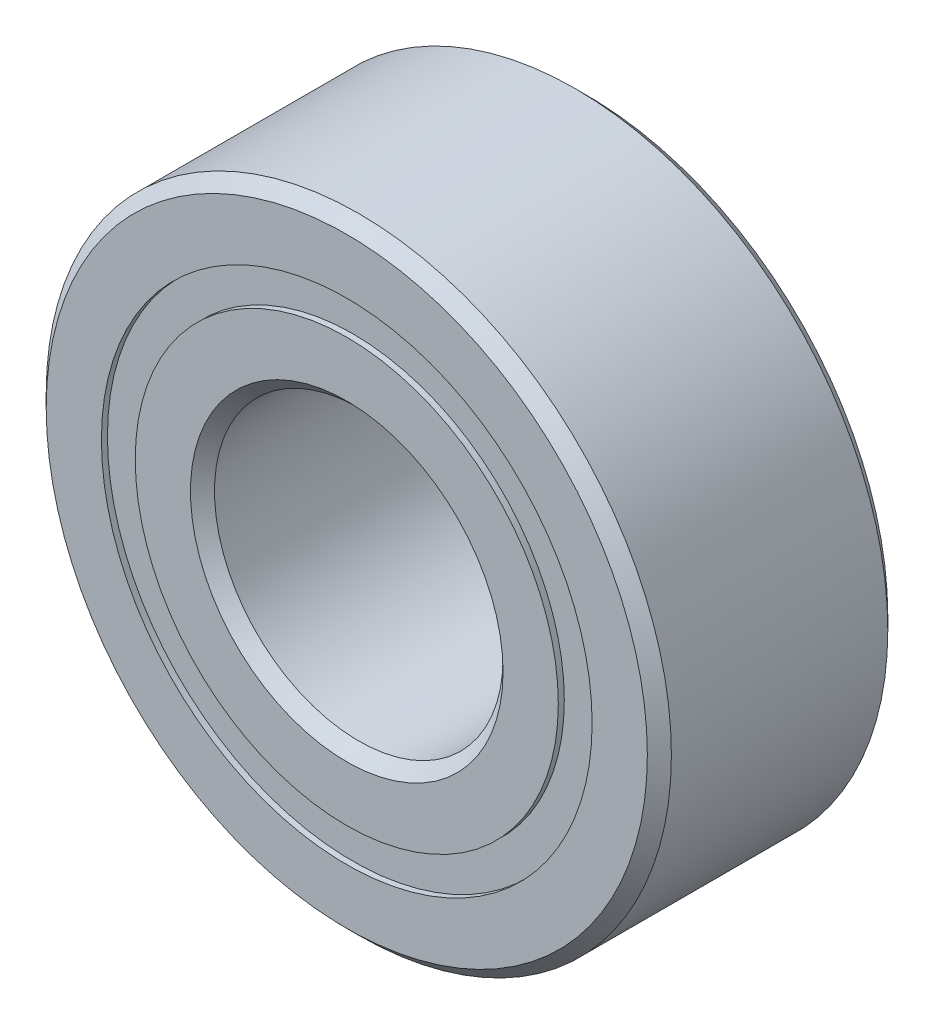
ISO-10303-21;
HEADER;
FILE_DESCRIPTION(('STEP AP214'),'2;1');
FILE_NAME('part.step','',(''),(''),'','','');
FILE_SCHEMA(('AUTOMOTIVE_DESIGN { 1 0 10303 214 1 1 1 1 }'));
ENDSEC;
DATA;
#1=APPLICATION_CONTEXT('core data for automotive mechanical design processes');
#2=APPLICATION_PROTOCOL_DEFINITION('international standard','automotive_design',2000,#1);
#3=PRODUCT_CONTEXT('',#1,'mechanical');
#4=PRODUCT('Part','Part','',(#3));
#5=PRODUCT_RELATED_PRODUCT_CATEGORY('part','',(#4));
#6=PRODUCT_DEFINITION_FORMATION('','',#4);
#7=PRODUCT_DEFINITION_CONTEXT('part definition',#1,'design');
#8=PRODUCT_DEFINITION('design','',#6,#7);
#9=PRODUCT_DEFINITION_SHAPE('','',#8);
#10=(LENGTH_UNIT() NAMED_UNIT(*) SI_UNIT(.MILLI.,.METRE.));
#11=(NAMED_UNIT(*) PLANE_ANGLE_UNIT() SI_UNIT($,.RADIAN.));
#12=(NAMED_UNIT(*) SI_UNIT($,.STERADIAN.) SOLID_ANGLE_UNIT());
#13=UNCERTAINTY_MEASURE_WITH_UNIT(LENGTH_MEASURE(1.E-05),#10,'distance_accuracy_value','');
#14=(GEOMETRIC_REPRESENTATION_CONTEXT(3) GLOBAL_UNCERTAINTY_ASSIGNED_CONTEXT((#13)) GLOBAL_UNIT_ASSIGNED_CONTEXT((#10,
#11,#12)) REPRESENTATION_CONTEXT('',''));
#15=CARTESIAN_POINT('',(0.,0.,0.));
#16=DIRECTION('',(0.,0.,1.));
#17=DIRECTION('',(1.,0.,0.));
#18=AXIS2_PLACEMENT_3D('',#15,#16,#17);
#19=CARTESIAN_POINT('',(0.,5.10164835164835,-2.375));
#20=DIRECTION('',(0.,0.,1.));
#21=DIRECTION('',(1.,0.,0.));
#22=AXIS2_PLACEMENT_3D('',#19,#20,#21);
#23=PLANE('',#22);
#24=CARTESIAN_POINT('',(0.,0.,-2.375));
#25=DIRECTION('',(0.,0.,1.));
#26=DIRECTION('',(1.,0.,0.));
#27=AXIS2_PLACEMENT_3D('',#24,#25,#26);
#28=CIRCLE('',#27,5.10164835164835);
#29=CARTESIAN_POINT('',(5.10164835164835,0.,-2.375));
#30=VERTEX_POINT('',#29);
#31=EDGE_CURVE('E70',#30,#30,#28,.T.);
#32=ORIENTED_EDGE('',*,*,#31,.F.);
#33=EDGE_LOOP('',(#32));
#34=FACE_BOUND('',#33,.T.);
#35=CARTESIAN_POINT('',(0.,0.,-2.375));
#36=DIRECTION('',(0.,0.,1.));
#37=DIRECTION('',(1.,0.,0.));
#38=AXIS2_PLACEMENT_3D('',#35,#36,#37);
#39=CIRCLE('',#38,4.39835164835165);
#40=CARTESIAN_POINT('',(4.39835164835165,0.,-2.375));
#41=VERTEX_POINT('',#40);
#42=EDGE_CURVE('E11',#41,#41,#39,.T.);
#43=ORIENTED_EDGE('',*,*,#42,.T.);
#44=EDGE_LOOP('',(#43));
#45=FACE_BOUND('',#44,.T.);
#46=ADVANCED_FACE('F56',(#34,#45),#23,.F.);
#47=CARTESIAN_POINT('',(0.,0.,2.5));
#48=DIRECTION('',(0.,0.,1.));
#49=DIRECTION('',(1.,0.,0.));
#50=AXIS2_PLACEMENT_3D('',#47,#48,#49);
#51=CYLINDRICAL_SURFACE('',#50,4.39835164835165);
#52=ORIENTED_EDGE('',*,*,#42,.F.);
#53=EDGE_LOOP('',(#52));
#54=FACE_BOUND('',#53,.T.);
#55=CARTESIAN_POINT('',(0.,0.,-1.16542887575844));
#56=DIRECTION('',(0.,0.,1.));
#57=DIRECTION('',(1.,0.,0.));
#58=AXIS2_PLACEMENT_3D('',#55,#56,#57);
#59=CIRCLE('',#58,4.39835164835165);
#60=CARTESIAN_POINT('',(4.39835164835165,0.,-1.16542887575844));
#61=VERTEX_POINT('',#60);
#62=EDGE_CURVE('E62',#61,#61,#59,.T.);
#63=ORIENTED_EDGE('',*,*,#62,.T.);
#64=EDGE_LOOP('',(#63));
#65=FACE_BOUND('',#64,.T.);
#66=ADVANCED_FACE('F79',(#54,#65),#51,.F.);
#67=CARTESIAN_POINT('',(0.,5.10164835164835,-1.16542887575844));
#68=DIRECTION('',(0.,0.,-1.));
#69=DIRECTION('',(-1.,0.,0.));
#70=AXIS2_PLACEMENT_3D('',#67,#68,#69);
#71=PLANE('',#70);
#72=ORIENTED_EDGE('',*,*,#62,.F.);
#73=EDGE_LOOP('',(#72));
#74=FACE_BOUND('',#73,.T.);
#75=CARTESIAN_POINT('',(0.,0.,-1.16542887575844));
#76=DIRECTION('',(0.,0.,1.));
#77=DIRECTION('',(1.,0.,0.));
#78=AXIS2_PLACEMENT_3D('',#75,#76,#77);
#79=CIRCLE('',#78,5.10164835164835);
#80=CARTESIAN_POINT('',(5.10164835164835,0.,-1.16542887575844));
#81=VERTEX_POINT('',#80);
#82=EDGE_CURVE('E66',#81,#81,#79,.T.);
#83=ORIENTED_EDGE('',*,*,#82,.T.);
#84=EDGE_LOOP('',(#83));
#85=FACE_BOUND('',#84,.T.);
#86=ADVANCED_FACE('F83',(#74,#85),#71,.F.);
#87=CARTESIAN_POINT('',(0.,0.,2.5));
#88=DIRECTION('',(0.,0.,1.));
#89=DIRECTION('',(1.,0.,0.));
#90=AXIS2_PLACEMENT_3D('',#87,#88,#89);
#91=CYLINDRICAL_SURFACE('',#90,5.10164835164835);
#92=ORIENTED_EDGE('',*,*,#82,.F.);
#93=EDGE_LOOP('',(#92));
#94=FACE_BOUND('',#93,.T.);
#95=ORIENTED_EDGE('',*,*,#31,.T.);
#96=EDGE_LOOP('',(#95));
#97=FACE_BOUND('',#96,.T.);
#98=ADVANCED_FACE('F76',(#94,#97),#91,.T.);
#99=CLOSED_SHELL('',(#46,#66,#86,#98));
#100=MANIFOLD_SOLID_BREP('B2',#99);
#101=CARTESIAN_POINT('',(0.,5.10164835164835,2.375));
#102=DIRECTION('',(0.,0.,-1.));
#103=DIRECTION('',(-1.,0.,0.));
#104=AXIS2_PLACEMENT_3D('',#101,#102,#103);
#105=PLANE('',#104);
#106=CARTESIAN_POINT('',(0.,0.,2.375));
#107=DIRECTION('',(0.,0.,1.));
#108=DIRECTION('',(1.,0.,0.));
#109=AXIS2_PLACEMENT_3D('',#106,#107,#108);
#110=CIRCLE('',#109,4.39835164835165);
#111=CARTESIAN_POINT('',(4.39835164835165,0.,2.375));
#112=VERTEX_POINT('',#111);
#113=EDGE_CURVE('E55',#112,#112,#110,.T.);
#114=ORIENTED_EDGE('',*,*,#113,.F.);
#115=EDGE_LOOP('',(#114));
#116=FACE_BOUND('',#115,.T.);
#117=CARTESIAN_POINT('',(0.,0.,2.375));
#118=DIRECTION('',(0.,0.,1.));
#119=DIRECTION('',(1.,0.,0.));
#120=AXIS2_PLACEMENT_3D('',#117,#118,#119);
#121=CIRCLE('',#120,5.10164835164835);
#122=CARTESIAN_POINT('',(5.10164835164835,0.,2.375));
#123=VERTEX_POINT('',#122);
#124=EDGE_CURVE('E133',#123,#123,#121,.T.);
#125=ORIENTED_EDGE('',*,*,#124,.T.);
#126=EDGE_LOOP('',(#125));
#127=FACE_BOUND('',#126,.T.);
#128=ADVANCED_FACE('F119',(#116,#127),#105,.F.);
#129=CARTESIAN_POINT('',(0.,0.,2.5));
#130=DIRECTION('',(0.,0.,1.));
#131=DIRECTION('',(1.,0.,0.));
#132=AXIS2_PLACEMENT_3D('',#129,#130,#131);
#133=CYLINDRICAL_SURFACE('',#132,4.39835164835165);
#134=CARTESIAN_POINT('',(0.,0.,1.16542887575844));
#135=DIRECTION('',(0.,0.,1.));
#136=DIRECTION('',(1.,0.,0.));
#137=AXIS2_PLACEMENT_3D('',#134,#135,#136);
#138=CIRCLE('',#137,4.39835164835165);
#139=CARTESIAN_POINT('',(4.39835164835165,0.,1.16542887575844));
#140=VERTEX_POINT('',#139);
#141=EDGE_CURVE('E125',#140,#140,#138,.T.);
#142=ORIENTED_EDGE('',*,*,#141,.F.);
#143=EDGE_LOOP('',(#142));
#144=FACE_BOUND('',#143,.T.);
#145=ORIENTED_EDGE('',*,*,#113,.T.);
#146=EDGE_LOOP('',(#145));
#147=FACE_BOUND('',#146,.T.);
#148=ADVANCED_FACE('F148',(#144,#147),#133,.F.);
#149=CARTESIAN_POINT('',(0.,5.10164835164835,1.16542887575844));
#150=DIRECTION('',(0.,0.,1.));
#151=DIRECTION('',(1.,0.,0.));
#152=AXIS2_PLACEMENT_3D('',#149,#150,#151);
#153=PLANE('',#152);
#154=CARTESIAN_POINT('',(0.,0.,1.16542887575844));
#155=DIRECTION('',(0.,0.,1.));
#156=DIRECTION('',(1.,0.,0.));
#157=AXIS2_PLACEMENT_3D('',#154,#155,#156);
#158=CIRCLE('',#157,5.10164835164835);
#159=CARTESIAN_POINT('',(5.10164835164835,0.,1.16542887575844));
#160=VERTEX_POINT('',#159);
#161=EDGE_CURVE('E129',#160,#160,#158,.T.);
#162=ORIENTED_EDGE('',*,*,#161,.F.);
#163=EDGE_LOOP('',(#162));
#164=FACE_BOUND('',#163,.T.);
#165=ORIENTED_EDGE('',*,*,#141,.T.);
#166=EDGE_LOOP('',(#165));
#167=FACE_BOUND('',#166,.T.);
#168=ADVANCED_FACE('F143',(#164,#167),#153,.F.);
#169=CARTESIAN_POINT('',(0.,0.,2.5));
#170=DIRECTION('',(0.,0.,1.));
#171=DIRECTION('',(1.,0.,0.));
#172=AXIS2_PLACEMENT_3D('',#169,#170,#171);
#173=CYLINDRICAL_SURFACE('',#172,5.10164835164835);
#174=ORIENTED_EDGE('',*,*,#124,.F.);
#175=EDGE_LOOP('',(#174));
#176=FACE_BOUND('',#175,.T.);
#177=ORIENTED_EDGE('',*,*,#161,.T.);
#178=EDGE_LOOP('',(#177));
#179=FACE_BOUND('',#178,.T.);
#180=ADVANCED_FACE('F140',(#176,#179),#173,.T.);
#181=CLOSED_SHELL('',(#128,#148,#168,#180));
#182=MANIFOLD_SOLID_BREP('B6',#181);
#183=CARTESIAN_POINT('',(-2.37499999999995,4.11362066797611,0.));
#184=DIRECTION('',(0.,0.,1.));
#185=DIRECTION('',(-0.499999999999989,0.866025403784445,0.));
#186=AXIS2_PLACEMENT_3D('',#183,#184,#185);
#187=SPHERICAL_SURFACE('',#186,1.16542887575844);
#188=CARTESIAN_POINT('',(-2.37499999999995,4.11362066797611,1.16542887575844));
#189=VERTEX_POINT('',#188);
#190=VERTEX_LOOP('',#189);
#191=FACE_BOUND('',#190,.T.);
#192=ADVANCED_FACE('F182',(#191),#187,.T.);
#193=CLOSED_SHELL('',(#192));
#194=MANIFOLD_SOLID_BREP('B50',#193);
#195=CARTESIAN_POINT('',(-4.11362066797606,2.37500000000005,0.));
#196=DIRECTION('',(0.,0.,1.));
#197=DIRECTION('',(-0.866025403784433,0.50000000000001,0.));
#198=AXIS2_PLACEMENT_3D('',#195,#196,#197);
#199=SPHERICAL_SURFACE('',#198,1.16542887575844);
#200=CARTESIAN_POINT('',(-4.11362066797606,2.37500000000005,1.16542887575844));
#201=VERTEX_POINT('',#200);
#202=VERTEX_LOOP('',#201);
#203=FACE_BOUND('',#202,.T.);
#204=ADVANCED_FACE('F205',(#203),#199,.T.);
#205=CLOSED_SHELL('',(#204));
#206=MANIFOLD_SOLID_BREP('B115',#205);
#207=CARTESIAN_POINT('',(-4.75,0.,0.));
#208=DIRECTION('',(0.,0.,1.));
#209=DIRECTION('',(-1.,0.,0.));
#210=AXIS2_PLACEMENT_3D('',#207,#208,#209);
#211=SPHERICAL_SURFACE('',#210,1.16542887575844);
#212=CARTESIAN_POINT('',(-4.75,0.,1.16542887575844));
#213=VERTEX_POINT('',#212);
#214=VERTEX_LOOP('',#213);
#215=FACE_BOUND('',#214,.T.);
#216=ADVANCED_FACE('F228',(#215),#211,.T.);
#217=CLOSED_SHELL('',(#216));
#218=MANIFOLD_SOLID_BREP('B178',#217);
#219=CARTESIAN_POINT('',(-4.1136206679761,-2.37499999999996,0.));
#220=DIRECTION('',(0.,0.,1.));
#221=DIRECTION('',(-0.866025403784443,-0.499999999999992,0.));
#222=AXIS2_PLACEMENT_3D('',#219,#220,#221);
#223=SPHERICAL_SURFACE('',#222,1.16542887575844);
#224=CARTESIAN_POINT('',(-4.1136206679761,-2.37499999999996,1.16542887575844));
#225=VERTEX_POINT('',#224);
#226=VERTEX_LOOP('',#225);
#227=FACE_BOUND('',#226,.T.);
#228=ADVANCED_FACE('F251',(#227),#223,.T.);
#229=CLOSED_SHELL('',(#228));
#230=MANIFOLD_SOLID_BREP('B201',#229);
#231=CARTESIAN_POINT('',(-2.37500000000003,-4.11362066797606,0.));
#232=DIRECTION('',(0.,0.,1.));
#233=DIRECTION('',(-0.500000000000007,-0.866025403784435,0.));
#234=AXIS2_PLACEMENT_3D('',#231,#232,#233);
#235=SPHERICAL_SURFACE('',#234,1.16542887575844);
#236=CARTESIAN_POINT('',(-2.37500000000003,-4.11362066797606,1.16542887575844));
#237=VERTEX_POINT('',#236);
#238=VERTEX_LOOP('',#237);
#239=FACE_BOUND('',#238,.T.);
#240=ADVANCED_FACE('F274',(#239),#235,.T.);
#241=CLOSED_SHELL('',(#240));
#242=MANIFOLD_SOLID_BREP('B224',#241);
#243=CARTESIAN_POINT('',(0.,-4.75,0.));
#244=DIRECTION('',(0.,0.,1.));
#245=DIRECTION('',(0.,-1.,0.));
#246=AXIS2_PLACEMENT_3D('',#243,#244,#245);
#247=SPHERICAL_SURFACE('',#246,1.16542887575844);
#248=CARTESIAN_POINT('',(0.,-4.75,1.16542887575844));
#249=VERTEX_POINT('',#248);
#250=VERTEX_LOOP('',#249);
#251=FACE_BOUND('',#250,.T.);
#252=ADVANCED_FACE('F297',(#251),#247,.T.);
#253=CLOSED_SHELL('',(#252));
#254=MANIFOLD_SOLID_BREP('B247',#253);
#255=CARTESIAN_POINT('',(2.37499999999998,-4.1136206679761,0.));
#256=DIRECTION('',(0.,0.,1.));
#257=DIRECTION('',(0.499999999999995,-0.866025403784442,0.));
#258=AXIS2_PLACEMENT_3D('',#255,#256,#257);
#259=SPHERICAL_SURFACE('',#258,1.16542887575844);
#260=CARTESIAN_POINT('',(2.37499999999998,-4.1136206679761,1.16542887575844));
#261=VERTEX_POINT('',#260);
#262=VERTEX_LOOP('',#261);
#263=FACE_BOUND('',#262,.T.);
#264=ADVANCED_FACE('F320',(#263),#259,.T.);
#265=CLOSED_SHELL('',(#264));
#266=MANIFOLD_SOLID_BREP('B270',#265);
#267=CARTESIAN_POINT('',(4.11362066797607,-2.37500000000002,0.));
#268=DIRECTION('',(0.,0.,1.));
#269=DIRECTION('',(0.866025403784436,-0.500000000000004,0.));
#270=AXIS2_PLACEMENT_3D('',#267,#268,#269);
#271=SPHERICAL_SURFACE('',#270,1.16542887575844);
#272=CARTESIAN_POINT('',(4.11362066797607,-2.37500000000002,1.16542887575844));
#273=VERTEX_POINT('',#272);
#274=VERTEX_LOOP('',#273);
#275=FACE_BOUND('',#274,.T.);
#276=ADVANCED_FACE('F343',(#275),#271,.T.);
#277=CLOSED_SHELL('',(#276));
#278=MANIFOLD_SOLID_BREP('B293',#277);
#279=CARTESIAN_POINT('',(4.75,0.,0.));
#280=DIRECTION('',(0.,0.,1.));
#281=DIRECTION('',(1.,0.,0.));
#282=AXIS2_PLACEMENT_3D('',#279,#280,#281);
#283=SPHERICAL_SURFACE('',#282,1.16542887575844);
#284=CARTESIAN_POINT('',(4.75,0.,1.16542887575844));
#285=VERTEX_POINT('',#284);
#286=VERTEX_LOOP('',#285);
#287=FACE_BOUND('',#286,.T.);
#288=ADVANCED_FACE('F366',(#287),#283,.T.);
#289=CLOSED_SHELL('',(#288));
#290=MANIFOLD_SOLID_BREP('B316',#289);
#291=CARTESIAN_POINT('',(4.11362066797609,2.37499999999999,0.));
#292=DIRECTION('',(0.,0.,1.));
#293=DIRECTION('',(0.86602540378444,0.499999999999998,0.));
#294=AXIS2_PLACEMENT_3D('',#291,#292,#293);
#295=SPHERICAL_SURFACE('',#294,1.16542887575844);
#296=CARTESIAN_POINT('',(4.11362066797609,2.37499999999999,1.16542887575844));
#297=VERTEX_POINT('',#296);
#298=VERTEX_LOOP('',#297);
#299=FACE_BOUND('',#298,.T.);
#300=ADVANCED_FACE('F389',(#299),#295,.T.);
#301=CLOSED_SHELL('',(#300));
#302=MANIFOLD_SOLID_BREP('B339',#301);
#303=CARTESIAN_POINT('',(2.375,4.11362066797608,0.));
#304=DIRECTION('',(0.,0.,1.));
#305=DIRECTION('',(0.500000000000001,0.866025403784438,0.));
#306=AXIS2_PLACEMENT_3D('',#303,#304,#305);
#307=SPHERICAL_SURFACE('',#306,1.16542887575844);
#308=CARTESIAN_POINT('',(2.375,4.11362066797608,1.16542887575844));
#309=VERTEX_POINT('',#308);
#310=VERTEX_LOOP('',#309);
#311=FACE_BOUND('',#310,.T.);
#312=ADVANCED_FACE('F412',(#311),#307,.T.);
#313=CLOSED_SHELL('',(#312));
#314=MANIFOLD_SOLID_BREP('B362',#313);
#315=CARTESIAN_POINT('',(0.,4.75,0.));
#316=DIRECTION('',(0.,0.,1.));
#317=DIRECTION('',(0.,1.,0.));
#318=AXIS2_PLACEMENT_3D('',#315,#316,#317);
#319=SPHERICAL_SURFACE('',#318,1.16542887575844);
#320=CARTESIAN_POINT('',(0.,4.75,1.16542887575844));
#321=VERTEX_POINT('',#320);
#322=VERTEX_LOOP('',#321);
#323=FACE_BOUND('',#322,.T.);
#324=ADVANCED_FACE('F437',(#323),#319,.T.);
#325=CLOSED_SHELL('',(#324));
#326=MANIFOLD_SOLID_BREP('B385',#325);
#327=CARTESIAN_POINT('',(0.,4.39835164835165,2.5));
#328=DIRECTION('',(0.,0.,-1.));
#329=DIRECTION('',(-1.,0.,0.));
#330=AXIS2_PLACEMENT_3D('',#327,#328,#329);
#331=PLANE('',#330);
#332=CARTESIAN_POINT('',(0.,0.,2.5));
#333=DIRECTION('',(0.,0.,1.));
#334=DIRECTION('',(1.,0.,0.));
#335=AXIS2_PLACEMENT_3D('',#332,#333,#334);
#336=CIRCLE('',#335,3.25);
#337=CARTESIAN_POINT('',(3.25,0.,2.5));
#338=VERTEX_POINT('',#337);
#339=EDGE_CURVE('E483',#338,#338,#336,.T.);
#340=ORIENTED_EDGE('',*,*,#339,.F.);
#341=EDGE_LOOP('',(#340));
#342=FACE_BOUND('',#341,.T.);
#343=CARTESIAN_POINT('',(0.,0.,2.5));
#344=DIRECTION('',(0.,0.,1.));
#345=DIRECTION('',(1.,0.,0.));
#346=AXIS2_PLACEMENT_3D('',#343,#344,#345);
#347=CIRCLE('',#346,4.39835164835165);
#348=CARTESIAN_POINT('',(4.39835164835165,0.,2.5));
#349=VERTEX_POINT('',#348);
#350=EDGE_CURVE('E436',#349,#349,#347,.T.);
#351=ORIENTED_EDGE('',*,*,#350,.T.);
#352=EDGE_LOOP('',(#351));
#353=FACE_BOUND('',#352,.T.);
#354=ADVANCED_FACE('F455',(#342,#353),#331,.F.);
#355=CARTESIAN_POINT('',(0.,0.,2.5));
#356=DIRECTION('',(0.,0.,1.));
#357=DIRECTION('',(1.,0.,0.));
#358=AXIS2_PLACEMENT_3D('',#355,#356,#357);
#359=CYLINDRICAL_SURFACE('',#358,4.39835164835165);
#360=ORIENTED_EDGE('',*,*,#350,.F.);
#361=EDGE_LOOP('',(#360));
#362=FACE_BOUND('',#361,.T.);
#363=CARTESIAN_POINT('',(0.,0.,1.11111111111111));
#364=DIRECTION('',(0.,0.,1.));
#365=DIRECTION('',(1.,0.,0.));
#366=AXIS2_PLACEMENT_3D('',#363,#364,#365);
#367=CIRCLE('',#366,4.39835164835165);
#368=CARTESIAN_POINT('',(4.39835164835165,0.,1.11111111111111));
#369=VERTEX_POINT('',#368);
#370=EDGE_CURVE('E461',#369,#369,#367,.T.);
#371=ORIENTED_EDGE('',*,*,#370,.T.);
#372=EDGE_LOOP('',(#371));
#373=FACE_BOUND('',#372,.T.);
#374=ADVANCED_FACE('F490',(#362,#373),#359,.T.);
#375=CARTESIAN_POINT('',(0.,0.,0.));
#376=DIRECTION('',(0.,0.,1.));
#377=DIRECTION('',(1.,0.,0.));
#378=AXIS2_PLACEMENT_3D('',#375,#376,#377);
#379=TOROIDAL_SURFACE('',#378,4.75,1.16542887575843);
#380=ORIENTED_EDGE('',*,*,#370,.F.);
#381=EDGE_LOOP('',(#380));
#382=FACE_BOUND('',#381,.T.);
#383=CARTESIAN_POINT('',(0.,0.,-1.11111111111111));
#384=DIRECTION('',(0.,0.,1.));
#385=DIRECTION('',(1.,0.,0.));
#386=AXIS2_PLACEMENT_3D('',#383,#384,#385);
#387=CIRCLE('',#386,4.39835164835165);
#388=CARTESIAN_POINT('',(4.39835164835165,0.,-1.11111111111111));
#389=VERTEX_POINT('',#388);
#390=EDGE_CURVE('E465',#389,#389,#387,.T.);
#391=ORIENTED_EDGE('',*,*,#390,.T.);
#392=EDGE_LOOP('',(#391));
#393=FACE_BOUND('',#392,.T.);
#394=ADVANCED_FACE('F494',(#382,#393),#379,.F.);
#395=CARTESIAN_POINT('',(0.,0.,2.5));
#396=DIRECTION('',(0.,0.,1.));
#397=DIRECTION('',(1.,0.,0.));
#398=AXIS2_PLACEMENT_3D('',#395,#396,#397);
#399=CYLINDRICAL_SURFACE('',#398,4.39835164835165);
#400=ORIENTED_EDGE('',*,*,#390,.F.);
#401=EDGE_LOOP('',(#400));
#402=FACE_BOUND('',#401,.T.);
#403=CARTESIAN_POINT('',(0.,0.,-2.5));
#404=DIRECTION('',(0.,0.,1.));
#405=DIRECTION('',(1.,0.,0.));
#406=AXIS2_PLACEMENT_3D('',#403,#404,#405);
#407=CIRCLE('',#406,4.39835164835165);
#408=CARTESIAN_POINT('',(4.39835164835165,0.,-2.5));
#409=VERTEX_POINT('',#408);
#410=EDGE_CURVE('E469',#409,#409,#407,.T.);
#411=ORIENTED_EDGE('',*,*,#410,.T.);
#412=EDGE_LOOP('',(#411));
#413=FACE_BOUND('',#412,.T.);
#414=ADVANCED_FACE('F499',(#402,#413),#399,.T.);
#415=CARTESIAN_POINT('',(0.,3.25,-2.5));
#416=DIRECTION('',(0.,0.,1.));
#417=DIRECTION('',(1.,0.,0.));
#418=AXIS2_PLACEMENT_3D('',#415,#416,#417);
#419=PLANE('',#418);
#420=ORIENTED_EDGE('',*,*,#410,.F.);
#421=EDGE_LOOP('',(#420));
#422=FACE_BOUND('',#421,.T.);
#423=CARTESIAN_POINT('',(0.,0.,-2.5));
#424=DIRECTION('',(0.,0.,1.));
#425=DIRECTION('',(1.,0.,0.));
#426=AXIS2_PLACEMENT_3D('',#423,#424,#425);
#427=CIRCLE('',#426,3.25);
#428=CARTESIAN_POINT('',(3.25,0.,-2.5));
#429=VERTEX_POINT('',#428);
#430=EDGE_CURVE('E474',#429,#429,#427,.T.);
#431=ORIENTED_EDGE('',*,*,#430,.T.);
#432=EDGE_LOOP('',(#431));
#433=FACE_BOUND('',#432,.T.);
#434=ADVANCED_FACE('F505',(#422,#433),#419,.F.);
#435=CARTESIAN_POINT('',(0.,0.,-2.25));
#436=DIRECTION('',(0.,0.,-1.));
#437=DIRECTION('',(-1.,0.,0.));
#438=AXIS2_PLACEMENT_3D('',#435,#436,#437);
#439=CONICAL_SURFACE('',#438,3.,0.785398163397447);
#440=ORIENTED_EDGE('',*,*,#430,.F.);
#441=EDGE_LOOP('',(#440));
#442=FACE_BOUND('',#441,.T.);
#443=CARTESIAN_POINT('',(0.,0.,-2.25));
#444=DIRECTION('',(0.,0.,1.));
#445=DIRECTION('',(1.,0.,0.));
#446=AXIS2_PLACEMENT_3D('',#443,#444,#445);
#447=CIRCLE('',#446,3.);
#448=CARTESIAN_POINT('',(3.,0.,-2.25));
#449=VERTEX_POINT('',#448);
#450=EDGE_CURVE('E477',#449,#449,#447,.T.);
#451=ORIENTED_EDGE('',*,*,#450,.T.);
#452=EDGE_LOOP('',(#451));
#453=FACE_BOUND('',#452,.T.);
#454=ADVANCED_FACE('F508',(#442,#453),#439,.F.);
#455=CARTESIAN_POINT('',(0.,0.,2.5));
#456=DIRECTION('',(0.,0.,1.));
#457=DIRECTION('',(1.,0.,0.));
#458=AXIS2_PLACEMENT_3D('',#455,#456,#457);
#459=CYLINDRICAL_SURFACE('',#458,3.);
#460=ORIENTED_EDGE('',*,*,#450,.F.);
#461=EDGE_LOOP('',(#460));
#462=FACE_BOUND('',#461,.T.);
#463=CARTESIAN_POINT('',(0.,0.,2.25));
#464=DIRECTION('',(0.,0.,1.));
#465=DIRECTION('',(1.,0.,0.));
#466=AXIS2_PLACEMENT_3D('',#463,#464,#465);
#467=CIRCLE('',#466,3.);
#468=CARTESIAN_POINT('',(3.,0.,2.25));
#469=VERTEX_POINT('',#468);
#470=EDGE_CURVE('E480',#469,#469,#467,.T.);
#471=ORIENTED_EDGE('',*,*,#470,.T.);
#472=EDGE_LOOP('',(#471));
#473=FACE_BOUND('',#472,.T.);
#474=ADVANCED_FACE('F512',(#462,#473),#459,.F.);
#475=CARTESIAN_POINT('',(0.,0.,2.5));
#476=DIRECTION('',(0.,0.,1.));
#477=DIRECTION('',(1.,0.,0.));
#478=AXIS2_PLACEMENT_3D('',#475,#476,#477);
#479=CONICAL_SURFACE('',#478,3.25,0.785398163397452);
#480=ORIENTED_EDGE('',*,*,#470,.F.);
#481=EDGE_LOOP('',(#480));
#482=FACE_BOUND('',#481,.T.);
#483=ORIENTED_EDGE('',*,*,#339,.T.);
#484=EDGE_LOOP('',(#483));
#485=FACE_BOUND('',#484,.T.);
#486=ADVANCED_FACE('F487',(#482,#485),#479,.F.);
#487=CLOSED_SHELL('',(#354,#374,#394,#414,#434,#454,#474,#486));
#488=MANIFOLD_SOLID_BREP('B408',#487);
#489=CARTESIAN_POINT('',(0.,0.,2.25));
#490=DIRECTION('',(0.,0.,-1.));
#491=DIRECTION('',(-1.,0.,0.));
#492=AXIS2_PLACEMENT_3D('',#489,#490,#491);
#493=CONICAL_SURFACE('',#492,6.5,0.785398163397445);
#494=CARTESIAN_POINT('',(0.,0.,2.5));
#495=DIRECTION('',(0.,0.,1.));
#496=DIRECTION('',(1.,0.,0.));
#497=AXIS2_PLACEMENT_3D('',#494,#495,#496);
#498=CIRCLE('',#497,6.25);
#499=CARTESIAN_POINT('',(6.25,0.,2.5));
#500=VERTEX_POINT('',#499);
#501=EDGE_CURVE('E594',#500,#500,#498,.T.);
#502=ORIENTED_EDGE('',*,*,#501,.F.);
#503=EDGE_LOOP('',(#502));
#504=FACE_BOUND('',#503,.T.);
#505=CARTESIAN_POINT('',(0.,0.,2.25));
#506=DIRECTION('',(0.,0.,1.));
#507=DIRECTION('',(1.,0.,0.));
#508=AXIS2_PLACEMENT_3D('',#505,#506,#507);
#509=CIRCLE('',#508,6.5);
#510=CARTESIAN_POINT('',(6.5,0.,2.25));
#511=VERTEX_POINT('',#510);
#512=EDGE_CURVE('E454',#511,#511,#509,.T.);
#513=ORIENTED_EDGE('',*,*,#512,.T.);
#514=EDGE_LOOP('',(#513));
#515=FACE_BOUND('',#514,.T.);
#516=ADVANCED_FACE('F566',(#504,#515),#493,.T.);
#517=CARTESIAN_POINT('',(0.,0.,2.5));
#518=DIRECTION('',(0.,0.,1.));
#519=DIRECTION('',(1.,0.,0.));
#520=AXIS2_PLACEMENT_3D('',#517,#518,#519);
#521=CYLINDRICAL_SURFACE('',#520,6.5);
#522=ORIENTED_EDGE('',*,*,#512,.F.);
#523=EDGE_LOOP('',(#522));
#524=FACE_BOUND('',#523,.T.);
#525=CARTESIAN_POINT('',(0.,0.,-2.25));
#526=DIRECTION('',(0.,0.,1.));
#527=DIRECTION('',(1.,0.,0.));
#528=AXIS2_PLACEMENT_3D('',#525,#526,#527);
#529=CIRCLE('',#528,6.5);
#530=CARTESIAN_POINT('',(6.5,0.,-2.25));
#531=VERTEX_POINT('',#530);
#532=EDGE_CURVE('E572',#531,#531,#529,.T.);
#533=ORIENTED_EDGE('',*,*,#532,.T.);
#534=EDGE_LOOP('',(#533));
#535=FACE_BOUND('',#534,.T.);
#536=ADVANCED_FACE('F601',(#524,#535),#521,.T.);
#537=CARTESIAN_POINT('',(0.,0.,-2.5));
#538=DIRECTION('',(0.,0.,1.));
#539=DIRECTION('',(1.,0.,0.));
#540=AXIS2_PLACEMENT_3D('',#537,#538,#539);
#541=CONICAL_SURFACE('',#540,6.25,0.785398163397445);
#542=ORIENTED_EDGE('',*,*,#532,.F.);
#543=EDGE_LOOP('',(#542));
#544=FACE_BOUND('',#543,.T.);
#545=CARTESIAN_POINT('',(0.,0.,-2.5));
#546=DIRECTION('',(0.,0.,1.));
#547=DIRECTION('',(1.,0.,0.));
#548=AXIS2_PLACEMENT_3D('',#545,#546,#547);
#549=CIRCLE('',#548,6.25);
#550=CARTESIAN_POINT('',(6.25,0.,-2.5));
#551=VERTEX_POINT('',#550);
#552=EDGE_CURVE('E576',#551,#551,#549,.T.);
#553=ORIENTED_EDGE('',*,*,#552,.T.);
#554=EDGE_LOOP('',(#553));
#555=FACE_BOUND('',#554,.T.);
#556=ADVANCED_FACE('F605',(#544,#555),#541,.T.);
#557=CARTESIAN_POINT('',(0.,6.25,-2.5));
#558=DIRECTION('',(0.,0.,1.));
#559=DIRECTION('',(1.,0.,0.));
#560=AXIS2_PLACEMENT_3D('',#557,#558,#559);
#561=PLANE('',#560);
#562=ORIENTED_EDGE('',*,*,#552,.F.);
#563=EDGE_LOOP('',(#562));
#564=FACE_BOUND('',#563,.T.);
#565=CARTESIAN_POINT('',(0.,0.,-2.5));
#566=DIRECTION('',(0.,0.,1.));
#567=DIRECTION('',(1.,0.,0.));
#568=AXIS2_PLACEMENT_3D('',#565,#566,#567);
#569=CIRCLE('',#568,5.10164835164835);
#570=CARTESIAN_POINT('',(5.10164835164835,0.,-2.5));
#571=VERTEX_POINT('',#570);
#572=EDGE_CURVE('E580',#571,#571,#569,.T.);
#573=ORIENTED_EDGE('',*,*,#572,.T.);
#574=EDGE_LOOP('',(#573));
#575=FACE_BOUND('',#574,.T.);
#576=ADVANCED_FACE('F610',(#564,#575),#561,.F.);
#577=CARTESIAN_POINT('',(0.,0.,2.5));
#578=DIRECTION('',(0.,0.,1.));
#579=DIRECTION('',(1.,0.,0.));
#580=AXIS2_PLACEMENT_3D('',#577,#578,#579);
#581=CYLINDRICAL_SURFACE('',#580,5.10164835164835);
#582=ORIENTED_EDGE('',*,*,#572,.F.);
#583=EDGE_LOOP('',(#582));
#584=FACE_BOUND('',#583,.T.);
#585=CARTESIAN_POINT('',(0.,0.,-1.11111111111111));
#586=DIRECTION('',(0.,0.,1.));
#587=DIRECTION('',(1.,0.,0.));
#588=AXIS2_PLACEMENT_3D('',#585,#586,#587);
#589=CIRCLE('',#588,5.10164835164835);
#590=CARTESIAN_POINT('',(5.10164835164835,0.,-1.11111111111111));
#591=VERTEX_POINT('',#590);
#592=EDGE_CURVE('E585',#591,#591,#589,.T.);
#593=ORIENTED_EDGE('',*,*,#592,.T.);
#594=EDGE_LOOP('',(#593));
#595=FACE_BOUND('',#594,.T.);
#596=ADVANCED_FACE('F616',(#584,#595),#581,.F.);
#597=CARTESIAN_POINT('',(0.,0.,0.));
#598=DIRECTION('',(0.,0.,1.));
#599=DIRECTION('',(1.,0.,0.));
#600=AXIS2_PLACEMENT_3D('',#597,#598,#599);
#601=TOROIDAL_SURFACE('',#600,4.75,1.16542887575844);
#602=ORIENTED_EDGE('',*,*,#592,.F.);
#603=EDGE_LOOP('',(#602));
#604=FACE_BOUND('',#603,.T.);
#605=CARTESIAN_POINT('',(0.,0.,1.11111111111111));
#606=DIRECTION('',(0.,0.,1.));
#607=DIRECTION('',(1.,0.,0.));
#608=AXIS2_PLACEMENT_3D('',#605,#606,#607);
#609=CIRCLE('',#608,5.10164835164835);
#610=CARTESIAN_POINT('',(5.10164835164835,0.,1.11111111111111));
#611=VERTEX_POINT('',#610);
#612=EDGE_CURVE('E588',#611,#611,#609,.T.);
#613=ORIENTED_EDGE('',*,*,#612,.T.);
#614=EDGE_LOOP('',(#613));
#615=FACE_BOUND('',#614,.T.);
#616=ADVANCED_FACE('F620',(#604,#615),#601,.F.);
#617=CARTESIAN_POINT('',(0.,0.,2.5));
#618=DIRECTION('',(0.,0.,1.));
#619=DIRECTION('',(1.,0.,0.));
#620=AXIS2_PLACEMENT_3D('',#617,#618,#619);
#621=CYLINDRICAL_SURFACE('',#620,5.10164835164835);
#622=ORIENTED_EDGE('',*,*,#612,.F.);
#623=EDGE_LOOP('',(#622));
#624=FACE_BOUND('',#623,.T.);
#625=CARTESIAN_POINT('',(0.,0.,2.5));
#626=DIRECTION('',(0.,0.,1.));
#627=DIRECTION('',(1.,0.,0.));
#628=AXIS2_PLACEMENT_3D('',#625,#626,#627);
#629=CIRCLE('',#628,5.10164835164835);
#630=CARTESIAN_POINT('',(5.10164835164835,0.,2.5));
#631=VERTEX_POINT('',#630);
#632=EDGE_CURVE('E591',#631,#631,#629,.T.);
#633=ORIENTED_EDGE('',*,*,#632,.T.);
#634=EDGE_LOOP('',(#633));
#635=FACE_BOUND('',#634,.T.);
#636=ADVANCED_FACE('F624',(#624,#635),#621,.F.);
#637=CARTESIAN_POINT('',(0.,6.25,2.5));
#638=DIRECTION('',(0.,0.,-1.));
#639=DIRECTION('',(-1.,0.,0.));
#640=AXIS2_PLACEMENT_3D('',#637,#638,#639);
#641=PLANE('',#640);
#642=ORIENTED_EDGE('',*,*,#632,.F.);
#643=EDGE_LOOP('',(#642));
#644=FACE_BOUND('',#643,.T.);
#645=ORIENTED_EDGE('',*,*,#501,.T.);
#646=EDGE_LOOP('',(#645));
#647=FACE_BOUND('',#646,.T.);
#648=ADVANCED_FACE('F598',(#644,#647),#641,.F.);
#649=CLOSED_SHELL('',(#516,#536,#556,#576,#596,#616,#636,#648));
#650=MANIFOLD_SOLID_BREP('B431',#649);
#651=ADVANCED_BREP_SHAPE_REPRESENTATION('',(#18,#100,#182,#194,#206,#218,#230,#242,#254,#266,
#278,#290,#302,#314,#326,#488,#650),#14);
#652=SHAPE_DEFINITION_REPRESENTATION(#9,#651);
ENDSEC;
END-ISO-10303-21;
